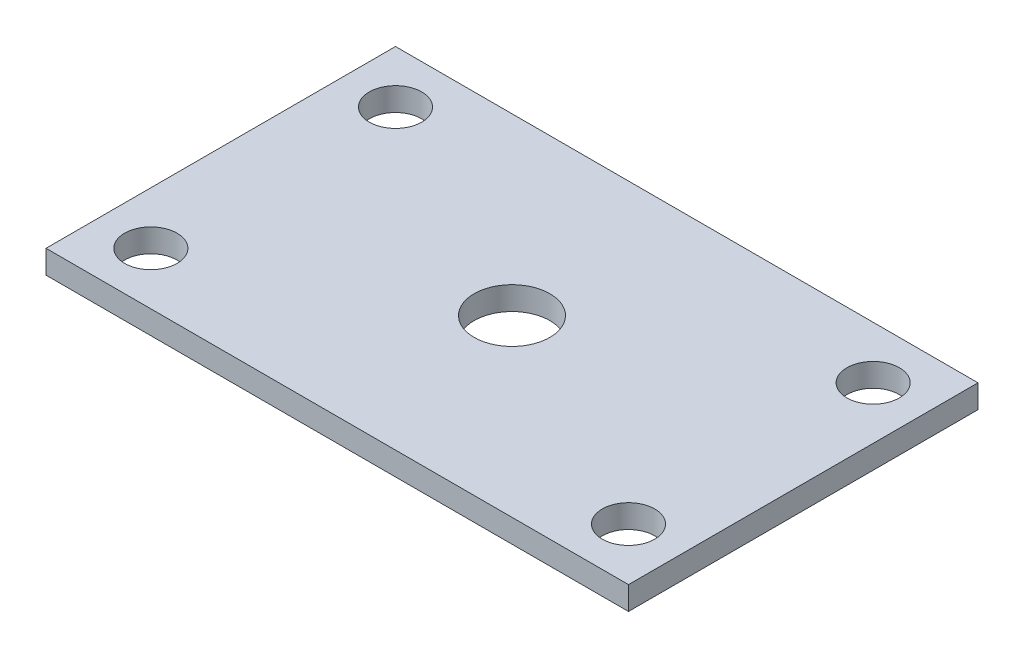
ISO-10303-21;
HEADER;
FILE_DESCRIPTION(('STEP AP214'),'2;1');
FILE_NAME('part.step','',(''),(''),'','','');
FILE_SCHEMA(('AUTOMOTIVE_DESIGN { 1 0 10303 214 1 1 1 1 }'));
ENDSEC;
DATA;
#1=APPLICATION_CONTEXT('core data for automotive mechanical design processes');
#2=APPLICATION_PROTOCOL_DEFINITION('international standard','automotive_design',2000,#1);
#3=PRODUCT_CONTEXT('',#1,'mechanical');
#4=PRODUCT('Part','Part','',(#3));
#5=PRODUCT_RELATED_PRODUCT_CATEGORY('part','',(#4));
#6=PRODUCT_DEFINITION_FORMATION('','',#4);
#7=PRODUCT_DEFINITION_CONTEXT('part definition',#1,'design');
#8=PRODUCT_DEFINITION('design','',#6,#7);
#9=PRODUCT_DEFINITION_SHAPE('','',#8);
#10=(LENGTH_UNIT() NAMED_UNIT(*) SI_UNIT(.MILLI.,.METRE.));
#11=(NAMED_UNIT(*) PLANE_ANGLE_UNIT() SI_UNIT($,.RADIAN.));
#12=(NAMED_UNIT(*) SI_UNIT($,.STERADIAN.) SOLID_ANGLE_UNIT());
#13=UNCERTAINTY_MEASURE_WITH_UNIT(LENGTH_MEASURE(1.E-05),#10,'distance_accuracy_value','');
#14=(GEOMETRIC_REPRESENTATION_CONTEXT(3) GLOBAL_UNCERTAINTY_ASSIGNED_CONTEXT((#13)) GLOBAL_UNIT_ASSIGNED_CONTEXT((#10,
#11,#12)) REPRESENTATION_CONTEXT('',''));
#15=CARTESIAN_POINT('',(0.,0.,0.));
#16=DIRECTION('',(0.,0.,1.));
#17=DIRECTION('',(1.,0.,0.));
#18=AXIS2_PLACEMENT_3D('',#15,#16,#17);
#19=CARTESIAN_POINT('',(0.,4.,0.));
#20=DIRECTION('',(0.,-1.,0.));
#21=DIRECTION('',(0.,0.,-1.));
#22=AXIS2_PLACEMENT_3D('',#19,#20,#21);
#23=PLANE('',#22);
#24=CARTESIAN_POINT('',(-41.,4.,21.));
#25=DIRECTION('',(0.,1.,0.));
#26=DIRECTION('',(0.,0.,-1.));
#27=AXIS2_PLACEMENT_3D('',#24,#25,#26);
#28=CIRCLE('',#27,4.5);
#29=CARTESIAN_POINT('',(-41.,4.,16.5));
#30=VERTEX_POINT('',#29);
#31=EDGE_CURVE('E131',#30,#30,#28,.T.);
#32=ORIENTED_EDGE('',*,*,#31,.F.);
#33=EDGE_LOOP('',(#32));
#34=FACE_BOUND('',#33,.T.);
#35=CARTESIAN_POINT('',(41.,4.,21.));
#36=DIRECTION('',(0.,1.,0.));
#37=DIRECTION('',(0.,0.,1.));
#38=AXIS2_PLACEMENT_3D('',#35,#36,#37);
#39=CIRCLE('',#38,4.5);
#40=CARTESIAN_POINT('',(41.,4.,25.5));
#41=VERTEX_POINT('',#40);
#42=EDGE_CURVE('E137',#41,#41,#39,.T.);
#43=ORIENTED_EDGE('',*,*,#42,.F.);
#44=EDGE_LOOP('',(#43));
#45=FACE_BOUND('',#44,.T.);
#46=CARTESIAN_POINT('',(41.,4.,-21.));
#47=DIRECTION('',(0.,1.,0.));
#48=DIRECTION('',(0.,0.,-1.));
#49=AXIS2_PLACEMENT_3D('',#46,#47,#48);
#50=CIRCLE('',#49,4.5);
#51=CARTESIAN_POINT('',(41.,4.,-25.5));
#52=VERTEX_POINT('',#51);
#53=EDGE_CURVE('E143',#52,#52,#50,.T.);
#54=ORIENTED_EDGE('',*,*,#53,.F.);
#55=EDGE_LOOP('',(#54));
#56=FACE_BOUND('',#55,.T.);
#57=CARTESIAN_POINT('',(-41.,4.,-21.));
#58=DIRECTION('',(0.,1.,0.));
#59=DIRECTION('',(0.,0.,1.));
#60=AXIS2_PLACEMENT_3D('',#57,#58,#59);
#61=CIRCLE('',#60,4.5);
#62=CARTESIAN_POINT('',(-41.,4.,-16.5));
#63=VERTEX_POINT('',#62);
#64=EDGE_CURVE('E125',#63,#63,#61,.T.);
#65=ORIENTED_EDGE('',*,*,#64,.F.);
#66=EDGE_LOOP('',(#65));
#67=FACE_BOUND('',#66,.T.);
#68=DIRECTION('',(0.,0.,-1.));
#69=VECTOR('',#68,1.);
#70=CARTESIAN_POINT('',(50.,4.,30.));
#71=LINE('',#70,#69);
#72=CARTESIAN_POINT('',(50.,4.,30.));
#73=VERTEX_POINT('',#72);
#74=CARTESIAN_POINT('',(50.,4.,-30.));
#75=VERTEX_POINT('',#74);
#76=EDGE_CURVE('E92',#73,#75,#71,.T.);
#77=ORIENTED_EDGE('',*,*,#76,.T.);
#78=DIRECTION('',(-1.,0.,0.));
#79=VECTOR('',#78,1.);
#80=CARTESIAN_POINT('',(-50.,4.,-30.));
#81=LINE('',#80,#79);
#82=CARTESIAN_POINT('',(-50.,4.,-30.));
#83=VERTEX_POINT('',#82);
#84=EDGE_CURVE('E87',#75,#83,#81,.T.);
#85=ORIENTED_EDGE('',*,*,#84,.T.);
#86=DIRECTION('',(0.,0.,1.));
#87=VECTOR('',#86,1.);
#88=CARTESIAN_POINT('',(-50.,4.,30.));
#89=LINE('',#88,#87);
#90=CARTESIAN_POINT('',(-50.,4.,30.));
#91=VERTEX_POINT('',#90);
#92=EDGE_CURVE('E90',#83,#91,#89,.T.);
#93=ORIENTED_EDGE('',*,*,#92,.T.);
#94=DIRECTION('',(1.,0.,0.));
#95=VECTOR('',#94,1.);
#96=CARTESIAN_POINT('',(-50.,4.,30.));
#97=LINE('',#96,#95);
#98=EDGE_CURVE('E57',#91,#73,#97,.T.);
#99=ORIENTED_EDGE('',*,*,#98,.T.);
#100=EDGE_LOOP('',(#77,#85,#93,#99));
#101=FACE_BOUND('',#100,.T.);
#102=CARTESIAN_POINT('',(0.,4.,0.));
#103=DIRECTION('',(0.,1.,0.));
#104=DIRECTION('',(0.,0.,1.));
#105=AXIS2_PLACEMENT_3D('',#102,#103,#104);
#106=CIRCLE('',#105,6.5);
#107=CARTESIAN_POINT('',(0.,4.,6.5));
#108=VERTEX_POINT('',#107);
#109=EDGE_CURVE('E107',#108,#108,#106,.T.);
#110=ORIENTED_EDGE('',*,*,#109,.F.);
#111=EDGE_LOOP('',(#110));
#112=FACE_BOUND('',#111,.T.);
#113=ADVANCED_FACE('F40',(#34,#45,#56,#67,#101,#112),#23,.F.);
#114=CARTESIAN_POINT('',(0.,0.,0.));
#115=DIRECTION('',(0.,-1.,0.));
#116=DIRECTION('',(0.,0.,-1.));
#117=AXIS2_PLACEMENT_3D('',#114,#115,#116);
#118=PLANE('',#117);
#119=CARTESIAN_POINT('',(-41.,0.,21.));
#120=DIRECTION('',(0.,1.,0.));
#121=DIRECTION('',(0.,0.,-1.));
#122=AXIS2_PLACEMENT_3D('',#119,#120,#121);
#123=CIRCLE('',#122,4.5);
#124=CARTESIAN_POINT('',(-41.,0.,16.5));
#125=VERTEX_POINT('',#124);
#126=EDGE_CURVE('E134',#125,#125,#123,.T.);
#127=ORIENTED_EDGE('',*,*,#126,.T.);
#128=EDGE_LOOP('',(#127));
#129=FACE_BOUND('',#128,.T.);
#130=CARTESIAN_POINT('',(41.,0.,21.));
#131=DIRECTION('',(0.,1.,0.));
#132=DIRECTION('',(0.,0.,1.));
#133=AXIS2_PLACEMENT_3D('',#130,#131,#132);
#134=CIRCLE('',#133,4.5);
#135=CARTESIAN_POINT('',(41.,0.,25.5));
#136=VERTEX_POINT('',#135);
#137=EDGE_CURVE('E140',#136,#136,#134,.T.);
#138=ORIENTED_EDGE('',*,*,#137,.T.);
#139=EDGE_LOOP('',(#138));
#140=FACE_BOUND('',#139,.T.);
#141=CARTESIAN_POINT('',(41.,0.,-21.));
#142=DIRECTION('',(0.,1.,0.));
#143=DIRECTION('',(0.,0.,-1.));
#144=AXIS2_PLACEMENT_3D('',#141,#142,#143);
#145=CIRCLE('',#144,4.5);
#146=CARTESIAN_POINT('',(41.,0.,-25.5));
#147=VERTEX_POINT('',#146);
#148=EDGE_CURVE('E128',#147,#147,#145,.T.);
#149=ORIENTED_EDGE('',*,*,#148,.T.);
#150=EDGE_LOOP('',(#149));
#151=FACE_BOUND('',#150,.T.);
#152=CARTESIAN_POINT('',(-41.,0.,-21.));
#153=DIRECTION('',(0.,1.,0.));
#154=DIRECTION('',(0.,0.,1.));
#155=AXIS2_PLACEMENT_3D('',#152,#153,#154);
#156=CIRCLE('',#155,4.5);
#157=CARTESIAN_POINT('',(-41.,0.,-16.5));
#158=VERTEX_POINT('',#157);
#159=EDGE_CURVE('E122',#158,#158,#156,.T.);
#160=ORIENTED_EDGE('',*,*,#159,.T.);
#161=EDGE_LOOP('',(#160));
#162=FACE_BOUND('',#161,.T.);
#163=DIRECTION('',(0.,0.,-1.));
#164=VECTOR('',#163,1.);
#165=CARTESIAN_POINT('',(50.,0.,30.));
#166=LINE('',#165,#164);
#167=CARTESIAN_POINT('',(50.,0.,30.));
#168=VERTEX_POINT('',#167);
#169=CARTESIAN_POINT('',(50.,0.,-30.));
#170=VERTEX_POINT('',#169);
#171=EDGE_CURVE('E104',#168,#170,#166,.T.);
#172=ORIENTED_EDGE('',*,*,#171,.F.);
#173=DIRECTION('',(1.,0.,0.));
#174=VECTOR('',#173,1.);
#175=CARTESIAN_POINT('',(-50.,0.,30.));
#176=LINE('',#175,#174);
#177=CARTESIAN_POINT('',(-50.,0.,30.));
#178=VERTEX_POINT('',#177);
#179=EDGE_CURVE('E80',#178,#168,#176,.T.);
#180=ORIENTED_EDGE('',*,*,#179,.F.);
#181=DIRECTION('',(0.,0.,1.));
#182=VECTOR('',#181,1.);
#183=CARTESIAN_POINT('',(-50.,0.,30.));
#184=LINE('',#183,#182);
#185=CARTESIAN_POINT('',(-50.,0.,-30.));
#186=VERTEX_POINT('',#185);
#187=EDGE_CURVE('E74',#186,#178,#184,.T.);
#188=ORIENTED_EDGE('',*,*,#187,.F.);
#189=DIRECTION('',(-1.,0.,0.));
#190=VECTOR('',#189,1.);
#191=CARTESIAN_POINT('',(-50.,0.,-30.));
#192=LINE('',#191,#190);
#193=EDGE_CURVE('E96',#170,#186,#192,.T.);
#194=ORIENTED_EDGE('',*,*,#193,.F.);
#195=EDGE_LOOP('',(#172,#180,#188,#194));
#196=FACE_BOUND('',#195,.T.);
#197=CARTESIAN_POINT('',(0.,0.,0.));
#198=DIRECTION('',(0.,1.,0.));
#199=DIRECTION('',(0.,0.,1.));
#200=AXIS2_PLACEMENT_3D('',#197,#198,#199);
#201=CIRCLE('',#200,6.5);
#202=CARTESIAN_POINT('',(0.,0.,6.5));
#203=VERTEX_POINT('',#202);
#204=EDGE_CURVE('E119',#203,#203,#201,.T.);
#205=ORIENTED_EDGE('',*,*,#204,.T.);
#206=EDGE_LOOP('',(#205));
#207=FACE_BOUND('',#206,.T.);
#208=ADVANCED_FACE('F115',(#129,#140,#151,#162,#196,#207),#118,.T.);
#209=CARTESIAN_POINT('',(50.,4.,30.));
#210=DIRECTION('',(-1.,0.,0.));
#211=DIRECTION('',(0.,0.,1.));
#212=AXIS2_PLACEMENT_3D('',#209,#210,#211);
#213=PLANE('',#212);
#214=ORIENTED_EDGE('',*,*,#171,.T.);
#215=DIRECTION('',(0.,-1.,0.));
#216=VECTOR('',#215,1.);
#217=CARTESIAN_POINT('',(50.,4.,-30.));
#218=LINE('',#217,#216);
#219=EDGE_CURVE('E11',#75,#170,#218,.T.);
#220=ORIENTED_EDGE('',*,*,#219,.F.);
#221=ORIENTED_EDGE('',*,*,#76,.F.);
#222=DIRECTION('',(0.,-1.,0.));
#223=VECTOR('',#222,1.);
#224=CARTESIAN_POINT('',(50.,4.,30.));
#225=LINE('',#224,#223);
#226=EDGE_CURVE('E100',#73,#168,#225,.T.);
#227=ORIENTED_EDGE('',*,*,#226,.T.);
#228=EDGE_LOOP('',(#214,#220,#221,#227));
#229=FACE_BOUND('',#228,.T.);
#230=ADVANCED_FACE('F42',(#229),#213,.F.);
#231=CARTESIAN_POINT('',(-50.,4.,-30.));
#232=DIRECTION('',(0.,0.,1.));
#233=DIRECTION('',(1.,0.,0.));
#234=AXIS2_PLACEMENT_3D('',#231,#232,#233);
#235=PLANE('',#234);
#236=ORIENTED_EDGE('',*,*,#193,.T.);
#237=DIRECTION('',(0.,-1.,0.));
#238=VECTOR('',#237,1.);
#239=CARTESIAN_POINT('',(-50.,4.,-30.));
#240=LINE('',#239,#238);
#241=EDGE_CURVE('E49',#83,#186,#240,.T.);
#242=ORIENTED_EDGE('',*,*,#241,.F.);
#243=ORIENTED_EDGE('',*,*,#84,.F.);
#244=ORIENTED_EDGE('',*,*,#219,.T.);
#245=EDGE_LOOP('',(#236,#242,#243,#244));
#246=FACE_BOUND('',#245,.T.);
#247=ADVANCED_FACE('F95',(#246),#235,.F.);
#248=CARTESIAN_POINT('',(-50.,4.,30.));
#249=DIRECTION('',(1.,0.,0.));
#250=DIRECTION('',(0.,0.,-1.));
#251=AXIS2_PLACEMENT_3D('',#248,#249,#250);
#252=PLANE('',#251);
#253=ORIENTED_EDGE('',*,*,#187,.T.);
#254=DIRECTION('',(0.,-1.,0.));
#255=VECTOR('',#254,1.);
#256=CARTESIAN_POINT('',(-50.,4.,30.));
#257=LINE('',#256,#255);
#258=EDGE_CURVE('E97',#91,#178,#257,.T.);
#259=ORIENTED_EDGE('',*,*,#258,.F.);
#260=ORIENTED_EDGE('',*,*,#92,.F.);
#261=ORIENTED_EDGE('',*,*,#241,.T.);
#262=EDGE_LOOP('',(#253,#259,#260,#261));
#263=FACE_BOUND('',#262,.T.);
#264=ADVANCED_FACE('F98',(#263),#252,.F.);
#265=CARTESIAN_POINT('',(-50.,4.,30.));
#266=DIRECTION('',(0.,0.,-1.));
#267=DIRECTION('',(-1.,0.,0.));
#268=AXIS2_PLACEMENT_3D('',#265,#266,#267);
#269=PLANE('',#268);
#270=ORIENTED_EDGE('',*,*,#179,.T.);
#271=ORIENTED_EDGE('',*,*,#226,.F.);
#272=ORIENTED_EDGE('',*,*,#98,.F.);
#273=ORIENTED_EDGE('',*,*,#258,.T.);
#274=EDGE_LOOP('',(#270,#271,#272,#273));
#275=FACE_BOUND('',#274,.T.);
#276=ADVANCED_FACE('F112',(#275),#269,.F.);
#277=CARTESIAN_POINT('',(0.,4.,0.));
#278=DIRECTION('',(0.,-1.,0.));
#279=DIRECTION('',(0.,0.,-1.));
#280=AXIS2_PLACEMENT_3D('',#277,#278,#279);
#281=CYLINDRICAL_SURFACE('',#280,6.5);
#282=ORIENTED_EDGE('',*,*,#109,.T.);
#283=EDGE_LOOP('',(#282));
#284=FACE_BOUND('',#283,.T.);
#285=ORIENTED_EDGE('',*,*,#204,.F.);
#286=EDGE_LOOP('',(#285));
#287=FACE_BOUND('',#286,.T.);
#288=ADVANCED_FACE('F166',(#284,#287),#281,.F.);
#289=CARTESIAN_POINT('',(-41.,0.,-21.));
#290=DIRECTION('',(0.,1.,0.));
#291=DIRECTION('',(0.,0.,1.));
#292=AXIS2_PLACEMENT_3D('',#289,#290,#291);
#293=CYLINDRICAL_SURFACE('',#292,4.5);
#294=ORIENTED_EDGE('',*,*,#159,.F.);
#295=EDGE_LOOP('',(#294));
#296=FACE_BOUND('',#295,.T.);
#297=ORIENTED_EDGE('',*,*,#64,.T.);
#298=EDGE_LOOP('',(#297));
#299=FACE_BOUND('',#298,.T.);
#300=ADVANCED_FACE('F155',(#296,#299),#293,.F.);
#301=CARTESIAN_POINT('',(41.,0.,-21.));
#302=DIRECTION('',(0.,1.,0.));
#303=DIRECTION('',(0.,0.,1.));
#304=AXIS2_PLACEMENT_3D('',#301,#302,#303);
#305=CYLINDRICAL_SURFACE('',#304,4.5);
#306=ORIENTED_EDGE('',*,*,#148,.F.);
#307=EDGE_LOOP('',(#306));
#308=FACE_BOUND('',#307,.T.);
#309=ORIENTED_EDGE('',*,*,#53,.T.);
#310=EDGE_LOOP('',(#309));
#311=FACE_BOUND('',#310,.T.);
#312=ADVANCED_FACE('F151',(#308,#311),#305,.F.);
#313=CARTESIAN_POINT('',(41.,0.,21.));
#314=DIRECTION('',(0.,1.,0.));
#315=DIRECTION('',(0.,0.,1.));
#316=AXIS2_PLACEMENT_3D('',#313,#314,#315);
#317=CYLINDRICAL_SURFACE('',#316,4.5);
#318=ORIENTED_EDGE('',*,*,#137,.F.);
#319=EDGE_LOOP('',(#318));
#320=FACE_BOUND('',#319,.T.);
#321=ORIENTED_EDGE('',*,*,#42,.T.);
#322=EDGE_LOOP('',(#321));
#323=FACE_BOUND('',#322,.T.);
#324=ADVANCED_FACE('F154',(#320,#323),#317,.F.);
#325=CARTESIAN_POINT('',(-41.,0.,21.));
#326=DIRECTION('',(0.,1.,0.));
#327=DIRECTION('',(0.,0.,1.));
#328=AXIS2_PLACEMENT_3D('',#325,#326,#327);
#329=CYLINDRICAL_SURFACE('',#328,4.5);
#330=ORIENTED_EDGE('',*,*,#126,.F.);
#331=EDGE_LOOP('',(#330));
#332=FACE_BOUND('',#331,.T.);
#333=ORIENTED_EDGE('',*,*,#31,.T.);
#334=EDGE_LOOP('',(#333));
#335=FACE_BOUND('',#334,.T.);
#336=ADVANCED_FACE('F176',(#332,#335),#329,.F.);
#337=CLOSED_SHELL('',(#113,#208,#230,#247,#264,#276,#288,#300,#312,#324,#336));
#338=MANIFOLD_SOLID_BREP('B2',#337);
#339=ADVANCED_BREP_SHAPE_REPRESENTATION('',(#18,#338),#14);
#340=SHAPE_DEFINITION_REPRESENTATION(#9,#339);
ENDSEC;
END-ISO-10303-21;
